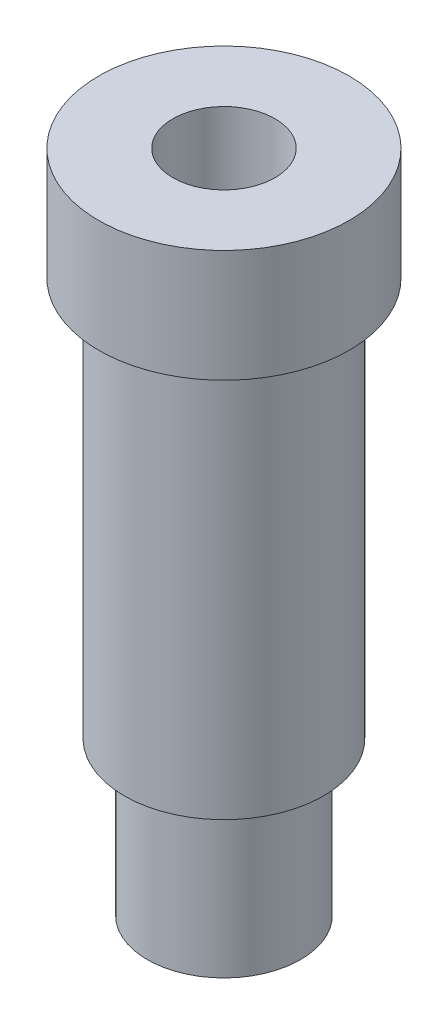
ISO-10303-21;
HEADER;
FILE_DESCRIPTION(('STEP AP214'),'2;1');
FILE_NAME('part.step','',(''),(''),'','','');
FILE_SCHEMA(('AUTOMOTIVE_DESIGN { 1 0 10303 214 1 1 1 1 }'));
ENDSEC;
DATA;
#1=APPLICATION_CONTEXT('core data for automotive mechanical design processes');
#2=APPLICATION_PROTOCOL_DEFINITION('international standard','automotive_design',2000,#1);
#3=PRODUCT_CONTEXT('',#1,'mechanical');
#4=PRODUCT('Part','Part','',(#3));
#5=PRODUCT_RELATED_PRODUCT_CATEGORY('part','',(#4));
#6=PRODUCT_DEFINITION_FORMATION('','',#4);
#7=PRODUCT_DEFINITION_CONTEXT('part definition',#1,'design');
#8=PRODUCT_DEFINITION('design','',#6,#7);
#9=PRODUCT_DEFINITION_SHAPE('','',#8);
#10=(LENGTH_UNIT() NAMED_UNIT(*) SI_UNIT(.MILLI.,.METRE.));
#11=(NAMED_UNIT(*) PLANE_ANGLE_UNIT() SI_UNIT($,.RADIAN.));
#12=(NAMED_UNIT(*) SI_UNIT($,.STERADIAN.) SOLID_ANGLE_UNIT());
#13=UNCERTAINTY_MEASURE_WITH_UNIT(LENGTH_MEASURE(1.E-05),#10,'distance_accuracy_value','');
#14=(GEOMETRIC_REPRESENTATION_CONTEXT(3) GLOBAL_UNCERTAINTY_ASSIGNED_CONTEXT((#13)) GLOBAL_UNIT_ASSIGNED_CONTEXT((#10,
#11,#12)) REPRESENTATION_CONTEXT('',''));
#15=CARTESIAN_POINT('',(0.,0.,0.));
#16=DIRECTION('',(0.,0.,1.));
#17=DIRECTION('',(1.,0.,0.));
#18=AXIS2_PLACEMENT_3D('',#15,#16,#17);
#19=CARTESIAN_POINT('',(0.,13.,0.));
#20=DIRECTION('',(0.,1.,0.));
#21=DIRECTION('',(0.,0.,1.));
#22=AXIS2_PLACEMENT_3D('',#19,#20,#21);
#23=PLANE('',#22);
#24=CARTESIAN_POINT('',(0.,13.,0.));
#25=DIRECTION('',(0.,1.,0.));
#26=DIRECTION('',(0.,0.,1.));
#27=AXIS2_PLACEMENT_3D('',#24,#25,#26);
#28=CIRCLE('',#27,1.);
#29=CARTESIAN_POINT('',(0.,13.,1.));
#30=VERTEX_POINT('',#29);
#31=EDGE_CURVE('E58',#30,#30,#28,.T.);
#32=ORIENTED_EDGE('',*,*,#31,.F.);
#33=EDGE_LOOP('',(#32));
#34=FACE_BOUND('',#33,.T.);
#35=CARTESIAN_POINT('',(0.,13.,0.));
#36=DIRECTION('',(0.,-1.,0.));
#37=DIRECTION('',(0.,0.,-1.));
#38=AXIS2_PLACEMENT_3D('',#35,#36,#37);
#39=CIRCLE('',#38,2.45);
#40=CARTESIAN_POINT('',(0.,13.,-2.45));
#41=VERTEX_POINT('',#40);
#42=EDGE_CURVE('E10',#41,#41,#39,.T.);
#43=ORIENTED_EDGE('',*,*,#42,.F.);
#44=EDGE_LOOP('',(#43));
#45=FACE_BOUND('',#44,.T.);
#46=ADVANCED_FACE('F30',(#34,#45),#23,.T.);
#47=CARTESIAN_POINT('',(0.,-2.82166877397155,0.));
#48=DIRECTION('',(0.,-1.,0.));
#49=DIRECTION('',(0.,0.,-1.));
#50=AXIS2_PLACEMENT_3D('',#47,#48,#49);
#51=CYLINDRICAL_SURFACE('',#50,2.45);
#52=ORIENTED_EDGE('',*,*,#42,.T.);
#53=EDGE_LOOP('',(#52));
#54=FACE_BOUND('',#53,.T.);
#55=CARTESIAN_POINT('',(0.,10.8,0.));
#56=DIRECTION('',(0.,-1.,0.));
#57=DIRECTION('',(0.,0.,-1.));
#58=AXIS2_PLACEMENT_3D('',#55,#56,#57);
#59=CIRCLE('',#58,2.45);
#60=CARTESIAN_POINT('',(0.,10.8,-2.45));
#61=VERTEX_POINT('',#60);
#62=EDGE_CURVE('E36',#61,#61,#59,.T.);
#63=ORIENTED_EDGE('',*,*,#62,.F.);
#64=EDGE_LOOP('',(#63));
#65=FACE_BOUND('',#64,.T.);
#66=ADVANCED_FACE('F66',(#54,#65),#51,.T.);
#67=CARTESIAN_POINT('',(2.45,10.8,0.));
#68=DIRECTION('',(0.,-1.,0.));
#69=DIRECTION('',(0.,0.,-1.));
#70=AXIS2_PLACEMENT_3D('',#67,#68,#69);
#71=PLANE('',#70);
#72=ORIENTED_EDGE('',*,*,#62,.T.);
#73=EDGE_LOOP('',(#72));
#74=FACE_BOUND('',#73,.T.);
#75=CARTESIAN_POINT('',(0.,10.8,0.));
#76=DIRECTION('',(0.,-1.,0.));
#77=DIRECTION('',(0.,0.,-1.));
#78=AXIS2_PLACEMENT_3D('',#75,#76,#77);
#79=CIRCLE('',#78,1.95);
#80=CARTESIAN_POINT('',(0.,10.8,-1.95));
#81=VERTEX_POINT('',#80);
#82=EDGE_CURVE('E40',#81,#81,#79,.T.);
#83=ORIENTED_EDGE('',*,*,#82,.F.);
#84=EDGE_LOOP('',(#83));
#85=FACE_BOUND('',#84,.T.);
#86=ADVANCED_FACE('F70',(#74,#85),#71,.T.);
#87=CARTESIAN_POINT('',(0.,-2.82166877397155,0.));
#88=DIRECTION('',(0.,-1.,0.));
#89=DIRECTION('',(0.,0.,-1.));
#90=AXIS2_PLACEMENT_3D('',#87,#88,#89);
#91=CYLINDRICAL_SURFACE('',#90,1.95);
#92=ORIENTED_EDGE('',*,*,#82,.T.);
#93=EDGE_LOOP('',(#92));
#94=FACE_BOUND('',#93,.T.);
#95=CARTESIAN_POINT('',(0.,3.,0.));
#96=DIRECTION('',(0.,-1.,0.));
#97=DIRECTION('',(0.,0.,-1.));
#98=AXIS2_PLACEMENT_3D('',#95,#96,#97);
#99=CIRCLE('',#98,1.95);
#100=CARTESIAN_POINT('',(0.,3.,-1.95));
#101=VERTEX_POINT('',#100);
#102=EDGE_CURVE('E44',#101,#101,#99,.T.);
#103=ORIENTED_EDGE('',*,*,#102,.F.);
#104=EDGE_LOOP('',(#103));
#105=FACE_BOUND('',#104,.T.);
#106=ADVANCED_FACE('F74',(#94,#105),#91,.T.);
#107=CARTESIAN_POINT('',(1.95,3.,0.));
#108=DIRECTION('',(0.,-1.,0.));
#109=DIRECTION('',(0.,0.,-1.));
#110=AXIS2_PLACEMENT_3D('',#107,#108,#109);
#111=PLANE('',#110);
#112=ORIENTED_EDGE('',*,*,#102,.T.);
#113=EDGE_LOOP('',(#112));
#114=FACE_BOUND('',#113,.T.);
#115=CARTESIAN_POINT('',(0.,3.,0.));
#116=DIRECTION('',(0.,-1.,0.));
#117=DIRECTION('',(0.,0.,-1.));
#118=AXIS2_PLACEMENT_3D('',#115,#116,#117);
#119=CIRCLE('',#118,1.5);
#120=CARTESIAN_POINT('',(0.,3.,-1.5));
#121=VERTEX_POINT('',#120);
#122=EDGE_CURVE('E49',#121,#121,#119,.T.);
#123=ORIENTED_EDGE('',*,*,#122,.F.);
#124=EDGE_LOOP('',(#123));
#125=FACE_BOUND('',#124,.T.);
#126=ADVANCED_FACE('F80',(#114,#125),#111,.T.);
#127=CARTESIAN_POINT('',(0.,-2.82166877397155,0.));
#128=DIRECTION('',(0.,-1.,0.));
#129=DIRECTION('',(0.,0.,-1.));
#130=AXIS2_PLACEMENT_3D('',#127,#128,#129);
#131=CYLINDRICAL_SURFACE('',#130,1.5);
#132=ORIENTED_EDGE('',*,*,#122,.T.);
#133=EDGE_LOOP('',(#132));
#134=FACE_BOUND('',#133,.T.);
#135=CARTESIAN_POINT('',(0.,0.,0.));
#136=DIRECTION('',(0.,-1.,0.));
#137=DIRECTION('',(0.,0.,-1.));
#138=AXIS2_PLACEMENT_3D('',#135,#136,#137);
#139=CIRCLE('',#138,1.5);
#140=CARTESIAN_POINT('',(0.,0.,-1.5));
#141=VERTEX_POINT('',#140);
#142=EDGE_CURVE('E52',#141,#141,#139,.T.);
#143=ORIENTED_EDGE('',*,*,#142,.F.);
#144=EDGE_LOOP('',(#143));
#145=FACE_BOUND('',#144,.T.);
#146=ADVANCED_FACE('F84',(#134,#145),#131,.T.);
#147=CARTESIAN_POINT('',(1.5,0.,0.));
#148=DIRECTION('',(0.,-1.,0.));
#149=DIRECTION('',(0.,0.,-1.));
#150=AXIS2_PLACEMENT_3D('',#147,#148,#149);
#151=PLANE('',#150);
#152=CARTESIAN_POINT('',(0.,0.,0.));
#153=DIRECTION('',(0.,1.,0.));
#154=DIRECTION('',(0.,0.,1.));
#155=AXIS2_PLACEMENT_3D('',#152,#153,#154);
#156=CIRCLE('',#155,1.);
#157=CARTESIAN_POINT('',(0.,0.,1.));
#158=VERTEX_POINT('',#157);
#159=EDGE_CURVE('E55',#158,#158,#156,.T.);
#160=ORIENTED_EDGE('',*,*,#159,.T.);
#161=EDGE_LOOP('',(#160));
#162=FACE_BOUND('',#161,.T.);
#163=ORIENTED_EDGE('',*,*,#142,.T.);
#164=EDGE_LOOP('',(#163));
#165=FACE_BOUND('',#164,.T.);
#166=ADVANCED_FACE('F88',(#162,#165),#151,.T.);
#167=CARTESIAN_POINT('',(0.,0.,0.));
#168=DIRECTION('',(0.,1.,0.));
#169=DIRECTION('',(0.,0.,1.));
#170=AXIS2_PLACEMENT_3D('',#167,#168,#169);
#171=CYLINDRICAL_SURFACE('',#170,1.);
#172=ORIENTED_EDGE('',*,*,#159,.F.);
#173=EDGE_LOOP('',(#172));
#174=FACE_BOUND('',#173,.T.);
#175=ORIENTED_EDGE('',*,*,#31,.T.);
#176=EDGE_LOOP('',(#175));
#177=FACE_BOUND('',#176,.T.);
#178=ADVANCED_FACE('F62',(#174,#177),#171,.F.);
#179=CLOSED_SHELL('',(#46,#66,#86,#106,#126,#146,#166,#178));
#180=MANIFOLD_SOLID_BREP('B2',#179);
#181=ADVANCED_BREP_SHAPE_REPRESENTATION('',(#18,#180),#14);
#182=SHAPE_DEFINITION_REPRESENTATION(#9,#181);
ENDSEC;
END-ISO-10303-21;
